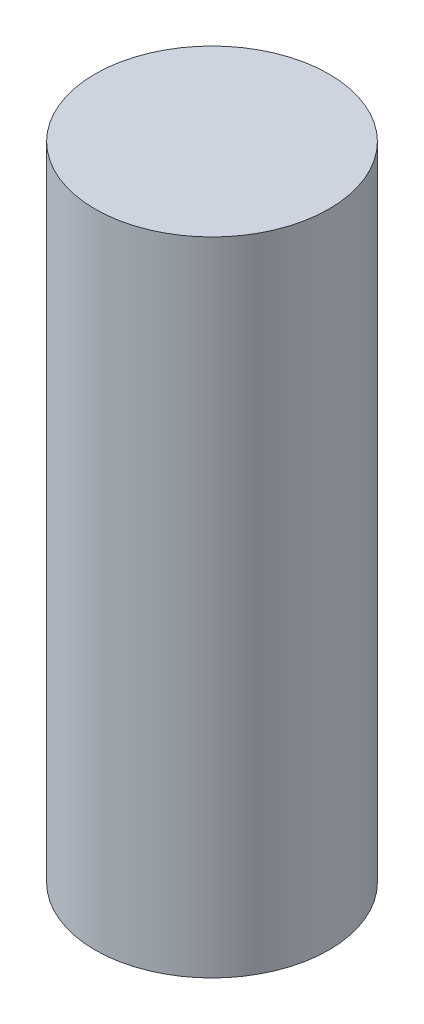
ISO-10303-21;
HEADER;
FILE_DESCRIPTION(('STEP AP214'),'2;1');
FILE_NAME('part.step','',(''),(''),'','','');
FILE_SCHEMA(('AUTOMOTIVE_DESIGN { 1 0 10303 214 1 1 1 1 }'));
ENDSEC;
DATA;
#1=APPLICATION_CONTEXT('core data for automotive mechanical design processes');
#2=APPLICATION_PROTOCOL_DEFINITION('international standard','automotive_design',2000,#1);
#3=PRODUCT_CONTEXT('',#1,'mechanical');
#4=PRODUCT('Part','Part','',(#3));
#5=PRODUCT_RELATED_PRODUCT_CATEGORY('part','',(#4));
#6=PRODUCT_DEFINITION_FORMATION('','',#4);
#7=PRODUCT_DEFINITION_CONTEXT('part definition',#1,'design');
#8=PRODUCT_DEFINITION('design','',#6,#7);
#9=PRODUCT_DEFINITION_SHAPE('','',#8);
#10=(LENGTH_UNIT() NAMED_UNIT(*) SI_UNIT(.MILLI.,.METRE.));
#11=(NAMED_UNIT(*) PLANE_ANGLE_UNIT() SI_UNIT($,.RADIAN.));
#12=(NAMED_UNIT(*) SI_UNIT($,.STERADIAN.) SOLID_ANGLE_UNIT());
#13=UNCERTAINTY_MEASURE_WITH_UNIT(LENGTH_MEASURE(1.E-05),#10,'distance_accuracy_value','');
#14=(GEOMETRIC_REPRESENTATION_CONTEXT(3) GLOBAL_UNCERTAINTY_ASSIGNED_CONTEXT((#13)) GLOBAL_UNIT_ASSIGNED_CONTEXT((#10,
#11,#12)) REPRESENTATION_CONTEXT('',''));
#15=CARTESIAN_POINT('',(0.,0.,0.));
#16=DIRECTION('',(0.,0.,1.));
#17=DIRECTION('',(1.,0.,0.));
#18=AXIS2_PLACEMENT_3D('',#15,#16,#17);
#19=CARTESIAN_POINT('',(0.,382.524,0.));
#20=DIRECTION('',(0.,-1.,0.));
#21=DIRECTION('',(0.,0.,-1.));
#22=AXIS2_PLACEMENT_3D('',#19,#20,#21);
#23=CYLINDRICAL_SURFACE('',#22,69.723);
#24=CARTESIAN_POINT('',(0.,382.524,0.));
#25=DIRECTION('',(0.,1.,0.));
#26=DIRECTION('',(0.,0.,1.));
#27=AXIS2_PLACEMENT_3D('',#24,#25,#26);
#28=CIRCLE('',#27,69.723);
#29=CARTESIAN_POINT('',(0.,382.524,69.723));
#30=VERTEX_POINT('',#29);
#31=EDGE_CURVE('E10',#30,#30,#28,.T.);
#32=ORIENTED_EDGE('',*,*,#31,.F.);
#33=EDGE_LOOP('',(#32));
#34=FACE_BOUND('',#33,.T.);
#35=CARTESIAN_POINT('',(0.,0.,0.));
#36=DIRECTION('',(0.,1.,0.));
#37=DIRECTION('',(0.,0.,1.));
#38=AXIS2_PLACEMENT_3D('',#35,#36,#37);
#39=CIRCLE('',#38,69.723);
#40=CARTESIAN_POINT('',(0.,0.,69.723));
#41=VERTEX_POINT('',#40);
#42=EDGE_CURVE('E34',#41,#41,#39,.T.);
#43=ORIENTED_EDGE('',*,*,#42,.T.);
#44=EDGE_LOOP('',(#43));
#45=FACE_BOUND('',#44,.T.);
#46=ADVANCED_FACE('F31',(#34,#45),#23,.T.);
#47=CARTESIAN_POINT('',(0.,382.524,0.));
#48=DIRECTION('',(0.,1.,0.));
#49=DIRECTION('',(0.,0.,1.));
#50=AXIS2_PLACEMENT_3D('',#47,#48,#49);
#51=PLANE('',#50);
#52=ORIENTED_EDGE('',*,*,#31,.T.);
#53=EDGE_LOOP('',(#52));
#54=FACE_BOUND('',#53,.T.);
#55=ADVANCED_FACE('F46',(#54),#51,.T.);
#56=CARTESIAN_POINT('',(0.,0.,0.));
#57=DIRECTION('',(0.,1.,0.));
#58=DIRECTION('',(0.,0.,1.));
#59=AXIS2_PLACEMENT_3D('',#56,#57,#58);
#60=PLANE('',#59);
#61=ORIENTED_EDGE('',*,*,#42,.F.);
#62=EDGE_LOOP('',(#61));
#63=FACE_BOUND('',#62,.T.);
#64=ADVANCED_FACE('F44',(#63),#60,.F.);
#65=CLOSED_SHELL('',(#46,#55,#64));
#66=MANIFOLD_SOLID_BREP('B2',#65);
#67=ADVANCED_BREP_SHAPE_REPRESENTATION('',(#18,#66),#14);
#68=SHAPE_DEFINITION_REPRESENTATION(#9,#67);
ENDSEC;
END-ISO-10303-21;
